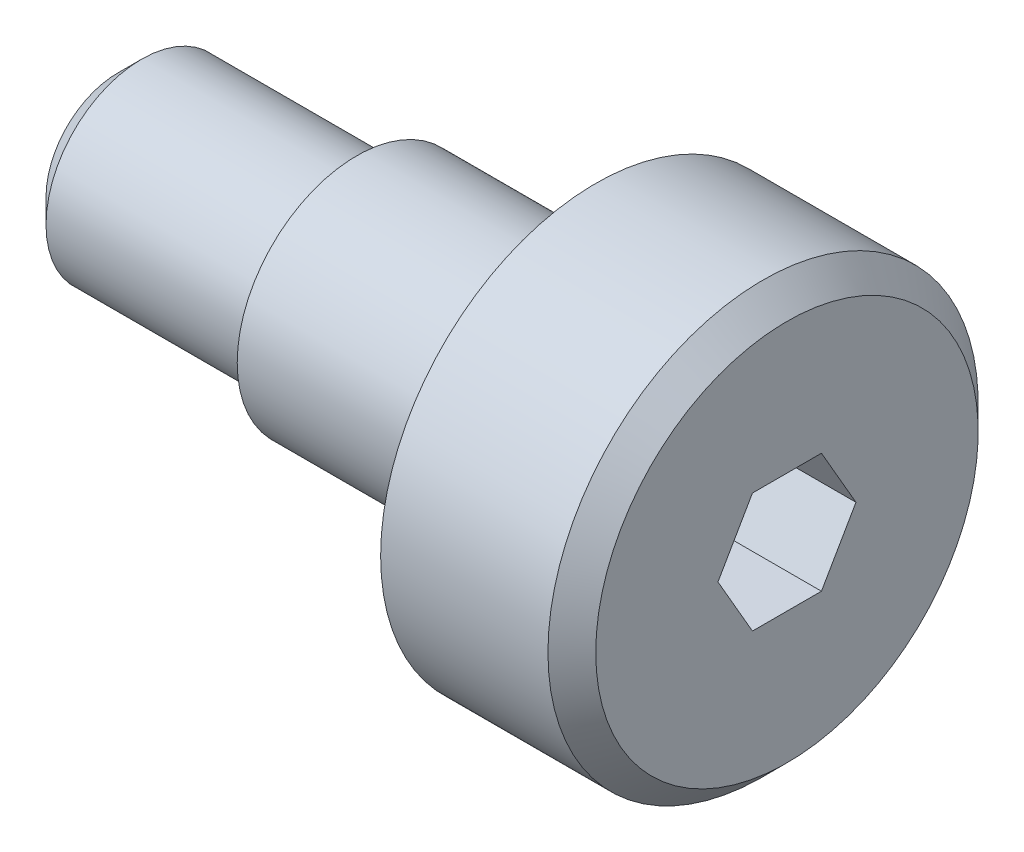
ISO-10303-21;
HEADER;
FILE_DESCRIPTION(('STEP AP214'),'2;1');
FILE_NAME('part.step','',(''),(''),'','','');
FILE_SCHEMA(('AUTOMOTIVE_DESIGN { 1 0 10303 214 1 1 1 1 }'));
ENDSEC;
DATA;
#1=APPLICATION_CONTEXT('core data for automotive mechanical design processes');
#2=APPLICATION_PROTOCOL_DEFINITION('international standard','automotive_design',2000,#1);
#3=PRODUCT_CONTEXT('',#1,'mechanical');
#4=PRODUCT('Part','Part','',(#3));
#5=PRODUCT_RELATED_PRODUCT_CATEGORY('part','',(#4));
#6=PRODUCT_DEFINITION_FORMATION('','',#4);
#7=PRODUCT_DEFINITION_CONTEXT('part definition',#1,'design');
#8=PRODUCT_DEFINITION('design','',#6,#7);
#9=PRODUCT_DEFINITION_SHAPE('','',#8);
#10=(LENGTH_UNIT() NAMED_UNIT(*) SI_UNIT(.MILLI.,.METRE.));
#11=(NAMED_UNIT(*) PLANE_ANGLE_UNIT() SI_UNIT($,.RADIAN.));
#12=(NAMED_UNIT(*) SI_UNIT($,.STERADIAN.) SOLID_ANGLE_UNIT());
#13=UNCERTAINTY_MEASURE_WITH_UNIT(LENGTH_MEASURE(1.E-05),#10,'distance_accuracy_value','');
#14=(GEOMETRIC_REPRESENTATION_CONTEXT(3) GLOBAL_UNCERTAINTY_ASSIGNED_CONTEXT((#13)) GLOBAL_UNIT_ASSIGNED_CONTEXT((#10,
#11,#12)) REPRESENTATION_CONTEXT('',''));
#15=CARTESIAN_POINT('',(0.,0.,0.));
#16=DIRECTION('',(0.,0.,1.));
#17=DIRECTION('',(1.,0.,0.));
#18=AXIS2_PLACEMENT_3D('',#15,#16,#17);
#19=CARTESIAN_POINT('',(0.,1.5,0.));
#20=DIRECTION('',(1.,0.,0.));
#21=DIRECTION('',(0.,0.,-1.));
#22=AXIS2_PLACEMENT_3D('',#19,#20,#21);
#23=PLANE('',#22);
#24=CARTESIAN_POINT('',(0.,0.,0.));
#25=DIRECTION('',(-1.,0.,0.));
#26=DIRECTION('',(0.,0.,1.));
#27=AXIS2_PLACEMENT_3D('',#24,#25,#26);
#28=CIRCLE('',#27,1.5);
#29=CARTESIAN_POINT('',(0.,0.,1.5));
#30=VERTEX_POINT('',#29);
#31=EDGE_CURVE('E137',#30,#30,#28,.T.);
#32=ORIENTED_EDGE('',*,*,#31,.T.);
#33=EDGE_LOOP('',(#32));
#34=FACE_BOUND('',#33,.T.);
#35=ADVANCED_FACE('F36',(#34),#23,.F.);
#36=CARTESIAN_POINT('',(14.,0.,0.));
#37=DIRECTION('',(-1.,0.,0.));
#38=DIRECTION('',(0.,0.,1.));
#39=AXIS2_PLACEMENT_3D('',#36,#37,#38);
#40=PLANE('',#39);
#41=DIRECTION('',(0.,0.866025403784438,0.5));
#42=VECTOR('',#41,1.);
#43=CARTESIAN_POINT('',(14.,0.,-1.44337567297407));
#44=LINE('',#43,#42);
#45=CARTESIAN_POINT('',(14.,0.,-1.44337567297407));
#46=VERTEX_POINT('',#45);
#47=CARTESIAN_POINT('',(14.,1.25,-0.721687836487032));
#48=VERTEX_POINT('',#47);
#49=EDGE_CURVE('E124',#46,#48,#44,.T.);
#50=ORIENTED_EDGE('',*,*,#49,.F.);
#51=DIRECTION('',(0.,0.866025403784439,-0.5));
#52=VECTOR('',#51,1.);
#53=CARTESIAN_POINT('',(14.,-1.25,-0.721687836487033));
#54=LINE('',#53,#52);
#55=CARTESIAN_POINT('',(14.,-1.25,-0.721687836487033));
#56=VERTEX_POINT('',#55);
#57=EDGE_CURVE('E50',#56,#46,#54,.T.);
#58=ORIENTED_EDGE('',*,*,#57,.F.);
#59=DIRECTION('',(0.,0.,-1.));
#60=VECTOR('',#59,1.);
#61=CARTESIAN_POINT('',(14.,-1.25,0.721687836487031));
#62=LINE('',#61,#60);
#63=CARTESIAN_POINT('',(14.,-1.25,0.721687836487031));
#64=VERTEX_POINT('',#63);
#65=EDGE_CURVE('E133',#64,#56,#62,.T.);
#66=ORIENTED_EDGE('',*,*,#65,.F.);
#67=DIRECTION('',(0.,-0.866025403784438,-0.5));
#68=VECTOR('',#67,1.);
#69=CARTESIAN_POINT('',(14.,0.,1.44337567297406));
#70=LINE('',#69,#68);
#71=CARTESIAN_POINT('',(14.,0.,1.44337567297406));
#72=VERTEX_POINT('',#71);
#73=EDGE_CURVE('E131',#72,#64,#70,.T.);
#74=ORIENTED_EDGE('',*,*,#73,.F.);
#75=DIRECTION('',(0.,-0.866025403784438,0.5));
#76=VECTOR('',#75,1.);
#77=CARTESIAN_POINT('',(14.,1.25,0.721687836487031));
#78=LINE('',#77,#76);
#79=CARTESIAN_POINT('',(14.,1.25,0.721687836487031));
#80=VERTEX_POINT('',#79);
#81=EDGE_CURVE('E98',#80,#72,#78,.T.);
#82=ORIENTED_EDGE('',*,*,#81,.F.);
#83=DIRECTION('',(0.,0.,1.));
#84=VECTOR('',#83,1.);
#85=CARTESIAN_POINT('',(14.,1.25,-0.721687836487032));
#86=LINE('',#85,#84);
#87=EDGE_CURVE('E127',#48,#80,#86,.T.);
#88=ORIENTED_EDGE('',*,*,#87,.F.);
#89=EDGE_LOOP('',(#50,#58,#66,#74,#82,#88));
#90=FACE_BOUND('',#89,.T.);
#91=CARTESIAN_POINT('',(14.,0.,0.));
#92=DIRECTION('',(-1.,0.,0.));
#93=DIRECTION('',(0.,0.,1.));
#94=AXIS2_PLACEMENT_3D('',#91,#92,#93);
#95=CIRCLE('',#94,4.);
#96=CARTESIAN_POINT('',(14.,0.,4.));
#97=VERTEX_POINT('',#96);
#98=EDGE_CURVE('E11',#97,#97,#95,.T.);
#99=ORIENTED_EDGE('',*,*,#98,.F.);
#100=EDGE_LOOP('',(#99));
#101=FACE_BOUND('',#100,.T.);
#102=ADVANCED_FACE('F167',(#90,#101),#40,.F.);
#103=CARTESIAN_POINT('',(14.,0.,0.));
#104=DIRECTION('',(-1.,0.,0.));
#105=DIRECTION('',(0.,0.,1.));
#106=AXIS2_PLACEMENT_3D('',#103,#104,#105);
#107=CONICAL_SURFACE('',#106,4.,0.785398163397446);
#108=CARTESIAN_POINT('',(13.5,0.,0.));
#109=DIRECTION('',(-1.,0.,0.));
#110=DIRECTION('',(0.,0.,1.));
#111=AXIS2_PLACEMENT_3D('',#108,#109,#110);
#112=CIRCLE('',#111,4.5);
#113=CARTESIAN_POINT('',(13.5,0.,4.5));
#114=VERTEX_POINT('',#113);
#115=EDGE_CURVE('E43',#114,#114,#112,.T.);
#116=ORIENTED_EDGE('',*,*,#115,.F.);
#117=EDGE_LOOP('',(#116));
#118=FACE_BOUND('',#117,.T.);
#119=ORIENTED_EDGE('',*,*,#98,.T.);
#120=EDGE_LOOP('',(#119));
#121=FACE_BOUND('',#120,.T.);
#122=ADVANCED_FACE('F164',(#118,#121),#107,.T.);
#123=CARTESIAN_POINT('',(0.,0.,0.));
#124=DIRECTION('',(-1.,0.,0.));
#125=DIRECTION('',(0.,0.,1.));
#126=AXIS2_PLACEMENT_3D('',#123,#124,#125);
#127=CYLINDRICAL_SURFACE('',#126,4.5);
#128=CARTESIAN_POINT('',(10.,0.,0.));
#129=DIRECTION('',(-1.,0.,0.));
#130=DIRECTION('',(0.,0.,1.));
#131=AXIS2_PLACEMENT_3D('',#128,#129,#130);
#132=CIRCLE('',#131,4.5);
#133=CARTESIAN_POINT('',(10.,0.,4.5));
#134=VERTEX_POINT('',#133);
#135=EDGE_CURVE('E157',#134,#134,#132,.T.);
#136=ORIENTED_EDGE('',*,*,#135,.F.);
#137=EDGE_LOOP('',(#136));
#138=FACE_BOUND('',#137,.T.);
#139=ORIENTED_EDGE('',*,*,#115,.T.);
#140=EDGE_LOOP('',(#139));
#141=FACE_BOUND('',#140,.T.);
#142=ADVANCED_FACE('F162',(#138,#141),#127,.T.);
#143=CARTESIAN_POINT('',(10.,4.5,0.));
#144=DIRECTION('',(1.,0.,0.));
#145=DIRECTION('',(0.,0.,-1.));
#146=AXIS2_PLACEMENT_3D('',#143,#144,#145);
#147=PLANE('',#146);
#148=CARTESIAN_POINT('',(10.,0.,0.));
#149=DIRECTION('',(-1.,0.,0.));
#150=DIRECTION('',(0.,0.,1.));
#151=AXIS2_PLACEMENT_3D('',#148,#149,#150);
#152=CIRCLE('',#151,2.5);
#153=CARTESIAN_POINT('',(10.,0.,2.5));
#154=VERTEX_POINT('',#153);
#155=EDGE_CURVE('E154',#154,#154,#152,.T.);
#156=ORIENTED_EDGE('',*,*,#155,.F.);
#157=EDGE_LOOP('',(#156));
#158=FACE_BOUND('',#157,.T.);
#159=ORIENTED_EDGE('',*,*,#135,.T.);
#160=EDGE_LOOP('',(#159));
#161=FACE_BOUND('',#160,.T.);
#162=ADVANCED_FACE('F183',(#158,#161),#147,.F.);
#163=CARTESIAN_POINT('',(0.,0.,0.));
#164=DIRECTION('',(-1.,0.,0.));
#165=DIRECTION('',(0.,0.,1.));
#166=AXIS2_PLACEMENT_3D('',#163,#164,#165);
#167=CYLINDRICAL_SURFACE('',#166,2.5);
#168=CARTESIAN_POINT('',(5.,0.,0.));
#169=DIRECTION('',(-1.,0.,0.));
#170=DIRECTION('',(0.,0.,1.));
#171=AXIS2_PLACEMENT_3D('',#168,#169,#170);
#172=CIRCLE('',#171,2.5);
#173=CARTESIAN_POINT('',(5.,0.,2.5));
#174=VERTEX_POINT('',#173);
#175=EDGE_CURVE('E151',#174,#174,#172,.T.);
#176=ORIENTED_EDGE('',*,*,#175,.F.);
#177=EDGE_LOOP('',(#176));
#178=FACE_BOUND('',#177,.T.);
#179=ORIENTED_EDGE('',*,*,#155,.T.);
#180=EDGE_LOOP('',(#179));
#181=FACE_BOUND('',#180,.T.);
#182=ADVANCED_FACE('F187',(#178,#181),#167,.T.);
#183=CARTESIAN_POINT('',(5.,2.5,0.));
#184=DIRECTION('',(1.,0.,0.));
#185=DIRECTION('',(0.,0.,-1.));
#186=AXIS2_PLACEMENT_3D('',#183,#184,#185);
#187=PLANE('',#186);
#188=CARTESIAN_POINT('',(5.,0.,0.));
#189=DIRECTION('',(-1.,0.,0.));
#190=DIRECTION('',(0.,0.,1.));
#191=AXIS2_PLACEMENT_3D('',#188,#189,#190);
#192=CIRCLE('',#191,2.);
#193=CARTESIAN_POINT('',(5.,0.,2.));
#194=VERTEX_POINT('',#193);
#195=EDGE_CURVE('E148',#194,#194,#192,.T.);
#196=ORIENTED_EDGE('',*,*,#195,.F.);
#197=EDGE_LOOP('',(#196));
#198=FACE_BOUND('',#197,.T.);
#199=ORIENTED_EDGE('',*,*,#175,.T.);
#200=EDGE_LOOP('',(#199));
#201=FACE_BOUND('',#200,.T.);
#202=ADVANCED_FACE('F191',(#198,#201),#187,.F.);
#203=CARTESIAN_POINT('',(0.,0.,0.));
#204=DIRECTION('',(-1.,0.,0.));
#205=DIRECTION('',(0.,0.,1.));
#206=AXIS2_PLACEMENT_3D('',#203,#204,#205);
#207=CYLINDRICAL_SURFACE('',#206,2.);
#208=CARTESIAN_POINT('',(0.5,0.,0.));
#209=DIRECTION('',(-1.,0.,0.));
#210=DIRECTION('',(0.,0.,1.));
#211=AXIS2_PLACEMENT_3D('',#208,#209,#210);
#212=CIRCLE('',#211,2.);
#213=CARTESIAN_POINT('',(0.5,0.,2.));
#214=VERTEX_POINT('',#213);
#215=EDGE_CURVE('E145',#214,#214,#212,.T.);
#216=ORIENTED_EDGE('',*,*,#215,.F.);
#217=EDGE_LOOP('',(#216));
#218=FACE_BOUND('',#217,.T.);
#219=ORIENTED_EDGE('',*,*,#195,.T.);
#220=EDGE_LOOP('',(#219));
#221=FACE_BOUND('',#220,.T.);
#222=ADVANCED_FACE('F195',(#218,#221),#207,.T.);
#223=CARTESIAN_POINT('',(0.5,0.,0.));
#224=DIRECTION('',(1.,0.,0.));
#225=DIRECTION('',(0.,0.,-1.));
#226=AXIS2_PLACEMENT_3D('',#223,#224,#225);
#227=CONICAL_SURFACE('',#226,2.,0.785398163397448);
#228=ORIENTED_EDGE('',*,*,#31,.F.);
#229=EDGE_LOOP('',(#228));
#230=FACE_BOUND('',#229,.T.);
#231=ORIENTED_EDGE('',*,*,#215,.T.);
#232=EDGE_LOOP('',(#231));
#233=FACE_BOUND('',#232,.T.);
#234=ADVANCED_FACE('F199',(#230,#233),#227,.T.);
#235=CARTESIAN_POINT('',(10.,-1.25,-0.721687836487033));
#236=DIRECTION('',(0.,-0.5,-0.866025403784439));
#237=DIRECTION('',(0.,0.866025403784439,-0.5));
#238=AXIS2_PLACEMENT_3D('',#235,#236,#237);
#239=PLANE('',#238);
#240=ORIENTED_EDGE('',*,*,#57,.T.);
#241=DIRECTION('',(1.,0.,0.));
#242=VECTOR('',#241,1.);
#243=CARTESIAN_POINT('',(10.,0.,-1.44337567297407));
#244=LINE('',#243,#242);
#245=CARTESIAN_POINT('',(10.,0.,-1.44337567297407));
#246=VERTEX_POINT('',#245);
#247=EDGE_CURVE('E80',#246,#46,#244,.T.);
#248=ORIENTED_EDGE('',*,*,#247,.F.);
#249=DIRECTION('',(0.,0.866025403784439,-0.5));
#250=VECTOR('',#249,1.);
#251=CARTESIAN_POINT('',(10.,-1.25,-0.721687836487033));
#252=LINE('',#251,#250);
#253=CARTESIAN_POINT('',(10.,-1.25,-0.721687836487033));
#254=VERTEX_POINT('',#253);
#255=EDGE_CURVE('E135',#254,#246,#252,.T.);
#256=ORIENTED_EDGE('',*,*,#255,.F.);
#257=DIRECTION('',(1.,0.,0.));
#258=VECTOR('',#257,1.);
#259=CARTESIAN_POINT('',(10.,-1.25,-0.721687836487033));
#260=LINE('',#259,#258);
#261=EDGE_CURVE('E58',#254,#56,#260,.T.);
#262=ORIENTED_EDGE('',*,*,#261,.T.);
#263=EDGE_LOOP('',(#240,#248,#256,#262));
#264=FACE_BOUND('',#263,.T.);
#265=ADVANCED_FACE('F202',(#264),#239,.F.);
#266=CARTESIAN_POINT('',(10.,-1.25,0.721687836487031));
#267=DIRECTION('',(0.,-1.,0.));
#268=DIRECTION('',(0.,0.,-1.));
#269=AXIS2_PLACEMENT_3D('',#266,#267,#268);
#270=PLANE('',#269);
#271=ORIENTED_EDGE('',*,*,#65,.T.);
#272=ORIENTED_EDGE('',*,*,#261,.F.);
#273=DIRECTION('',(0.,0.,-1.));
#274=VECTOR('',#273,1.);
#275=CARTESIAN_POINT('',(10.,-1.25,0.721687836487031));
#276=LINE('',#275,#274);
#277=CARTESIAN_POINT('',(10.,-1.25,0.721687836487031));
#278=VERTEX_POINT('',#277);
#279=EDGE_CURVE('E110',#278,#254,#276,.T.);
#280=ORIENTED_EDGE('',*,*,#279,.F.);
#281=DIRECTION('',(1.,0.,0.));
#282=VECTOR('',#281,1.);
#283=CARTESIAN_POINT('',(10.,-1.25,0.721687836487031));
#284=LINE('',#283,#282);
#285=EDGE_CURVE('E102',#278,#64,#284,.T.);
#286=ORIENTED_EDGE('',*,*,#285,.T.);
#287=EDGE_LOOP('',(#271,#272,#280,#286));
#288=FACE_BOUND('',#287,.T.);
#289=ADVANCED_FACE('F205',(#288),#270,.F.);
#290=CARTESIAN_POINT('',(10.,0.,1.44337567297406));
#291=DIRECTION('',(0.,-0.5,0.866025403784438));
#292=DIRECTION('',(0.,-0.866025403784438,-0.5));
#293=AXIS2_PLACEMENT_3D('',#290,#291,#292);
#294=PLANE('',#293);
#295=ORIENTED_EDGE('',*,*,#73,.T.);
#296=ORIENTED_EDGE('',*,*,#285,.F.);
#297=DIRECTION('',(0.,-0.866025403784438,-0.5));
#298=VECTOR('',#297,1.);
#299=CARTESIAN_POINT('',(10.,0.,1.44337567297406));
#300=LINE('',#299,#298);
#301=CARTESIAN_POINT('',(10.,0.,1.44337567297406));
#302=VERTEX_POINT('',#301);
#303=EDGE_CURVE('E106',#302,#278,#300,.T.);
#304=ORIENTED_EDGE('',*,*,#303,.F.);
#305=DIRECTION('',(1.,0.,0.));
#306=VECTOR('',#305,1.);
#307=CARTESIAN_POINT('',(10.,0.,1.44337567297406));
#308=LINE('',#307,#306);
#309=EDGE_CURVE('E91',#302,#72,#308,.T.);
#310=ORIENTED_EDGE('',*,*,#309,.T.);
#311=EDGE_LOOP('',(#295,#296,#304,#310));
#312=FACE_BOUND('',#311,.T.);
#313=ADVANCED_FACE('F107',(#312),#294,.F.);
#314=CARTESIAN_POINT('',(10.,1.25,0.721687836487031));
#315=DIRECTION('',(0.,0.5,0.866025403784439));
#316=DIRECTION('',(0.,-0.866025403784438,0.5));
#317=AXIS2_PLACEMENT_3D('',#314,#315,#316);
#318=PLANE('',#317);
#319=ORIENTED_EDGE('',*,*,#81,.T.);
#320=ORIENTED_EDGE('',*,*,#309,.F.);
#321=DIRECTION('',(0.,-0.866025403784438,0.5));
#322=VECTOR('',#321,1.);
#323=CARTESIAN_POINT('',(10.,1.25,0.721687836487031));
#324=LINE('',#323,#322);
#325=CARTESIAN_POINT('',(10.,1.25,0.721687836487031));
#326=VERTEX_POINT('',#325);
#327=EDGE_CURVE('E95',#326,#302,#324,.T.);
#328=ORIENTED_EDGE('',*,*,#327,.F.);
#329=DIRECTION('',(1.,0.,0.));
#330=VECTOR('',#329,1.);
#331=CARTESIAN_POINT('',(10.,1.25,0.721687836487031));
#332=LINE('',#331,#330);
#333=EDGE_CURVE('E103',#326,#80,#332,.T.);
#334=ORIENTED_EDGE('',*,*,#333,.T.);
#335=EDGE_LOOP('',(#319,#320,#328,#334));
#336=FACE_BOUND('',#335,.T.);
#337=ADVANCED_FACE('F93',(#336),#318,.F.);
#338=CARTESIAN_POINT('',(10.,1.25,-0.721687836487032));
#339=DIRECTION('',(0.,1.,0.));
#340=DIRECTION('',(0.,0.,1.));
#341=AXIS2_PLACEMENT_3D('',#338,#339,#340);
#342=PLANE('',#341);
#343=ORIENTED_EDGE('',*,*,#87,.T.);
#344=ORIENTED_EDGE('',*,*,#333,.F.);
#345=DIRECTION('',(0.,0.,1.));
#346=VECTOR('',#345,1.);
#347=CARTESIAN_POINT('',(10.,1.25,-0.721687836487032));
#348=LINE('',#347,#346);
#349=CARTESIAN_POINT('',(10.,1.25,-0.721687836487032));
#350=VERTEX_POINT('',#349);
#351=EDGE_CURVE('E116',#350,#326,#348,.T.);
#352=ORIENTED_EDGE('',*,*,#351,.F.);
#353=DIRECTION('',(1.,0.,0.));
#354=VECTOR('',#353,1.);
#355=CARTESIAN_POINT('',(10.,1.25,-0.721687836487032));
#356=LINE('',#355,#354);
#357=EDGE_CURVE('E140',#350,#48,#356,.T.);
#358=ORIENTED_EDGE('',*,*,#357,.T.);
#359=EDGE_LOOP('',(#343,#344,#352,#358));
#360=FACE_BOUND('',#359,.T.);
#361=ADVANCED_FACE('F209',(#360),#342,.F.);
#362=CARTESIAN_POINT('',(10.,0.,-1.44337567297407));
#363=DIRECTION('',(0.,0.5,-0.866025403784438));
#364=DIRECTION('',(0.,0.866025403784438,0.5));
#365=AXIS2_PLACEMENT_3D('',#362,#363,#364);
#366=PLANE('',#365);
#367=ORIENTED_EDGE('',*,*,#49,.T.);
#368=ORIENTED_EDGE('',*,*,#357,.F.);
#369=DIRECTION('',(0.,0.866025403784438,0.5));
#370=VECTOR('',#369,1.);
#371=CARTESIAN_POINT('',(10.,0.,-1.44337567297407));
#372=LINE('',#371,#370);
#373=EDGE_CURVE('E118',#246,#350,#372,.T.);
#374=ORIENTED_EDGE('',*,*,#373,.F.);
#375=ORIENTED_EDGE('',*,*,#247,.T.);
#376=EDGE_LOOP('',(#367,#368,#374,#375));
#377=FACE_BOUND('',#376,.T.);
#378=ADVANCED_FACE('F206',(#377),#366,.F.);
#379=CARTESIAN_POINT('',(10.,0.,0.));
#380=DIRECTION('',(1.,0.,0.));
#381=DIRECTION('',(0.,0.,-1.));
#382=AXIS2_PLACEMENT_3D('',#379,#380,#381);
#383=PLANE('',#382);
#384=ORIENTED_EDGE('',*,*,#255,.T.);
#385=ORIENTED_EDGE('',*,*,#373,.T.);
#386=ORIENTED_EDGE('',*,*,#351,.T.);
#387=ORIENTED_EDGE('',*,*,#327,.T.);
#388=ORIENTED_EDGE('',*,*,#303,.T.);
#389=ORIENTED_EDGE('',*,*,#279,.T.);
#390=EDGE_LOOP('',(#384,#385,#386,#387,#388,#389));
#391=FACE_BOUND('',#390,.T.);
#392=ADVANCED_FACE('F113',(#391),#383,.T.);
#393=CLOSED_SHELL('',(#35,#102,#122,#142,#162,#182,#202,#222,#234,#265,#289,#313,#337,#361,#378,#392));
#394=MANIFOLD_SOLID_BREP('B2',#393);
#395=ADVANCED_BREP_SHAPE_REPRESENTATION('',(#18,#394),#14);
#396=SHAPE_DEFINITION_REPRESENTATION(#9,#395);
ENDSEC;
END-ISO-10303-21;
